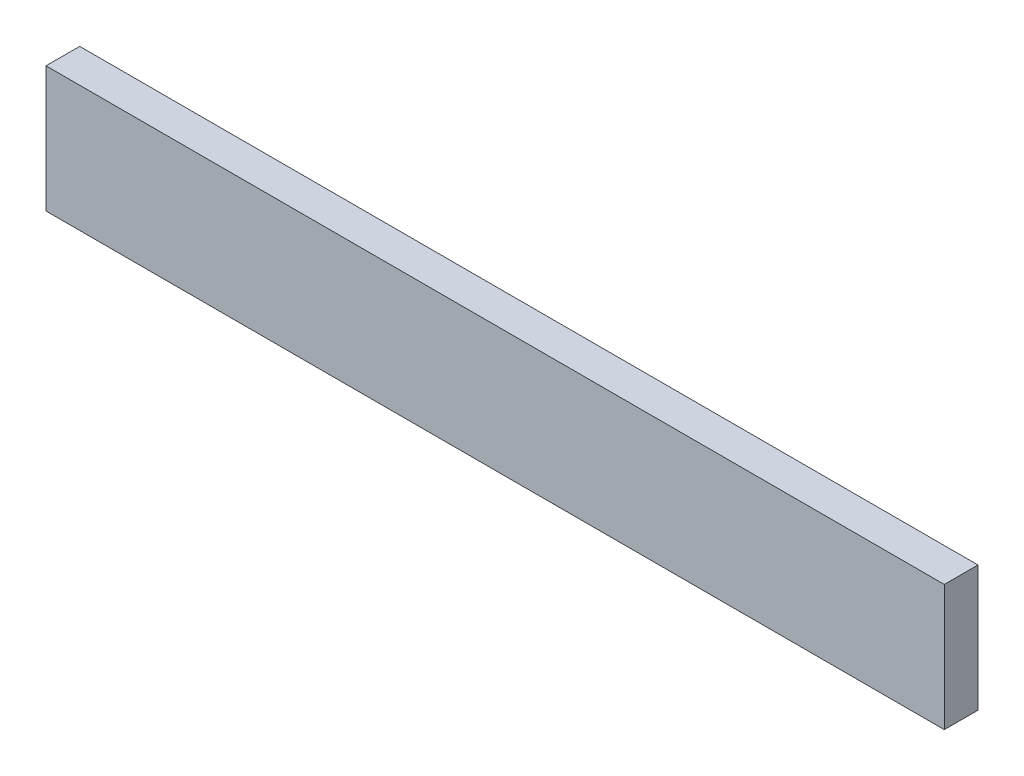
ISO-10303-21;
HEADER;
FILE_DESCRIPTION(('STEP AP214'),'2;1');
FILE_NAME('part.step','',(''),(''),'','','');
FILE_SCHEMA(('AUTOMOTIVE_DESIGN { 1 0 10303 214 1 1 1 1 }'));
ENDSEC;
DATA;
#1=APPLICATION_CONTEXT('core data for automotive mechanical design processes');
#2=APPLICATION_PROTOCOL_DEFINITION('international standard','automotive_design',2000,#1);
#3=PRODUCT_CONTEXT('',#1,'mechanical');
#4=PRODUCT('Part','Part','',(#3));
#5=PRODUCT_RELATED_PRODUCT_CATEGORY('part','',(#4));
#6=PRODUCT_DEFINITION_FORMATION('','',#4);
#7=PRODUCT_DEFINITION_CONTEXT('part definition',#1,'design');
#8=PRODUCT_DEFINITION('design','',#6,#7);
#9=PRODUCT_DEFINITION_SHAPE('','',#8);
#10=(LENGTH_UNIT() NAMED_UNIT(*) SI_UNIT(.MILLI.,.METRE.));
#11=(NAMED_UNIT(*) PLANE_ANGLE_UNIT() SI_UNIT($,.RADIAN.));
#12=(NAMED_UNIT(*) SI_UNIT($,.STERADIAN.) SOLID_ANGLE_UNIT());
#13=UNCERTAINTY_MEASURE_WITH_UNIT(LENGTH_MEASURE(1.E-05),#10,'distance_accuracy_value','');
#14=(GEOMETRIC_REPRESENTATION_CONTEXT(3) GLOBAL_UNCERTAINTY_ASSIGNED_CONTEXT((#13)) GLOBAL_UNIT_ASSIGNED_CONTEXT((#10,
#11,#12)) REPRESENTATION_CONTEXT('',''));
#15=CARTESIAN_POINT('',(0.,0.,0.));
#16=DIRECTION('',(0.,0.,1.));
#17=DIRECTION('',(1.,0.,0.));
#18=AXIS2_PLACEMENT_3D('',#15,#16,#17);
#19=CARTESIAN_POINT('',(0.,0.,2.99999999999999));
#20=DIRECTION('',(1.,0.,0.));
#21=DIRECTION('',(0.,0.,-1.));
#22=AXIS2_PLACEMENT_3D('',#19,#20,#21);
#23=PLANE('',#22);
#24=DIRECTION('',(0.,-1.,0.));
#25=VECTOR('',#24,1.);
#26=CARTESIAN_POINT('',(0.,0.,0.));
#27=LINE('',#26,#25);
#28=CARTESIAN_POINT('',(0.,11.2,0.));
#29=VERTEX_POINT('',#28);
#30=CARTESIAN_POINT('',(0.,0.,0.));
#31=VERTEX_POINT('',#30);
#32=EDGE_CURVE('E96',#29,#31,#27,.T.);
#33=ORIENTED_EDGE('',*,*,#32,.T.);
#34=DIRECTION('',(0.,0.,-1.));
#35=VECTOR('',#34,1.);
#36=CARTESIAN_POINT('',(0.,0.,2.99999999999999));
#37=LINE('',#36,#35);
#38=CARTESIAN_POINT('',(0.,0.,2.99999999999999));
#39=VERTEX_POINT('',#38);
#40=EDGE_CURVE('E11',#39,#31,#37,.T.);
#41=ORIENTED_EDGE('',*,*,#40,.F.);
#42=DIRECTION('',(0.,-1.,0.));
#43=VECTOR('',#42,1.);
#44=CARTESIAN_POINT('',(0.,0.,2.99999999999999));
#45=LINE('',#44,#43);
#46=CARTESIAN_POINT('',(0.,11.2,2.99999999999999));
#47=VERTEX_POINT('',#46);
#48=EDGE_CURVE('E84',#47,#39,#45,.T.);
#49=ORIENTED_EDGE('',*,*,#48,.F.);
#50=DIRECTION('',(0.,0.,-1.));
#51=VECTOR('',#50,1.);
#52=CARTESIAN_POINT('',(0.,11.2,2.99999999999999));
#53=LINE('',#52,#51);
#54=EDGE_CURVE('E92',#47,#29,#53,.T.);
#55=ORIENTED_EDGE('',*,*,#54,.T.);
#56=EDGE_LOOP('',(#33,#41,#49,#55));
#57=FACE_BOUND('',#56,.T.);
#58=ADVANCED_FACE('F33',(#57),#23,.F.);
#59=CARTESIAN_POINT('',(0.,0.,2.99999999999999));
#60=DIRECTION('',(0.,1.,0.));
#61=DIRECTION('',(0.,0.,1.));
#62=AXIS2_PLACEMENT_3D('',#59,#60,#61);
#63=PLANE('',#62);
#64=DIRECTION('',(1.,0.,0.));
#65=VECTOR('',#64,1.);
#66=CARTESIAN_POINT('',(0.,0.,0.));
#67=LINE('',#66,#65);
#68=CARTESIAN_POINT('',(80.,0.,0.));
#69=VERTEX_POINT('',#68);
#70=EDGE_CURVE('E88',#31,#69,#67,.T.);
#71=ORIENTED_EDGE('',*,*,#70,.T.);
#72=DIRECTION('',(0.,0.,-1.));
#73=VECTOR('',#72,1.);
#74=CARTESIAN_POINT('',(80.,0.,2.99999999999999));
#75=LINE('',#74,#73);
#76=CARTESIAN_POINT('',(80.,0.,2.99999999999999));
#77=VERTEX_POINT('',#76);
#78=EDGE_CURVE('E41',#77,#69,#75,.T.);
#79=ORIENTED_EDGE('',*,*,#78,.F.);
#80=DIRECTION('',(1.,0.,0.));
#81=VECTOR('',#80,1.);
#82=CARTESIAN_POINT('',(0.,0.,2.99999999999999));
#83=LINE('',#82,#81);
#84=EDGE_CURVE('E79',#39,#77,#83,.T.);
#85=ORIENTED_EDGE('',*,*,#84,.F.);
#86=ORIENTED_EDGE('',*,*,#40,.T.);
#87=EDGE_LOOP('',(#71,#79,#85,#86));
#88=FACE_BOUND('',#87,.T.);
#89=ADVANCED_FACE('F87',(#88),#63,.F.);
#90=CARTESIAN_POINT('',(80.,0.,2.99999999999999));
#91=DIRECTION('',(-1.,0.,0.));
#92=DIRECTION('',(0.,0.,1.));
#93=AXIS2_PLACEMENT_3D('',#90,#91,#92);
#94=PLANE('',#93);
#95=DIRECTION('',(0.,1.,0.));
#96=VECTOR('',#95,1.);
#97=CARTESIAN_POINT('',(80.,0.,0.));
#98=LINE('',#97,#96);
#99=CARTESIAN_POINT('',(80.,11.2,0.));
#100=VERTEX_POINT('',#99);
#101=EDGE_CURVE('E66',#69,#100,#98,.T.);
#102=ORIENTED_EDGE('',*,*,#101,.T.);
#103=DIRECTION('',(0.,0.,-1.));
#104=VECTOR('',#103,1.);
#105=CARTESIAN_POINT('',(80.,11.2,2.99999999999999));
#106=LINE('',#105,#104);
#107=CARTESIAN_POINT('',(80.,11.2,2.99999999999999));
#108=VERTEX_POINT('',#107);
#109=EDGE_CURVE('E89',#108,#100,#106,.T.);
#110=ORIENTED_EDGE('',*,*,#109,.F.);
#111=DIRECTION('',(0.,1.,0.));
#112=VECTOR('',#111,1.);
#113=CARTESIAN_POINT('',(80.,0.,2.99999999999999));
#114=LINE('',#113,#112);
#115=EDGE_CURVE('E82',#77,#108,#114,.T.);
#116=ORIENTED_EDGE('',*,*,#115,.F.);
#117=ORIENTED_EDGE('',*,*,#78,.T.);
#118=EDGE_LOOP('',(#102,#110,#116,#117));
#119=FACE_BOUND('',#118,.T.);
#120=ADVANCED_FACE('F90',(#119),#94,.F.);
#121=CARTESIAN_POINT('',(0.,11.2,2.99999999999999));
#122=DIRECTION('',(0.,-1.,0.));
#123=DIRECTION('',(0.,0.,-1.));
#124=AXIS2_PLACEMENT_3D('',#121,#122,#123);
#125=PLANE('',#124);
#126=DIRECTION('',(-1.,0.,0.));
#127=VECTOR('',#126,1.);
#128=CARTESIAN_POINT('',(0.,11.2,0.));
#129=LINE('',#128,#127);
#130=EDGE_CURVE('E72',#100,#29,#129,.T.);
#131=ORIENTED_EDGE('',*,*,#130,.T.);
#132=ORIENTED_EDGE('',*,*,#54,.F.);
#133=DIRECTION('',(-1.,0.,0.));
#134=VECTOR('',#133,1.);
#135=CARTESIAN_POINT('',(0.,11.2,2.99999999999999));
#136=LINE('',#135,#134);
#137=EDGE_CURVE('E49',#108,#47,#136,.T.);
#138=ORIENTED_EDGE('',*,*,#137,.F.);
#139=ORIENTED_EDGE('',*,*,#109,.T.);
#140=EDGE_LOOP('',(#131,#132,#138,#139));
#141=FACE_BOUND('',#140,.T.);
#142=ADVANCED_FACE('F103',(#141),#125,.F.);
#143=CARTESIAN_POINT('',(0.,0.,2.99999999999999));
#144=DIRECTION('',(0.,0.,-1.));
#145=DIRECTION('',(-1.,0.,0.));
#146=AXIS2_PLACEMENT_3D('',#143,#144,#145);
#147=PLANE('',#146);
#148=ORIENTED_EDGE('',*,*,#48,.T.);
#149=ORIENTED_EDGE('',*,*,#84,.T.);
#150=ORIENTED_EDGE('',*,*,#115,.T.);
#151=ORIENTED_EDGE('',*,*,#137,.T.);
#152=EDGE_LOOP('',(#148,#149,#150,#151));
#153=FACE_BOUND('',#152,.T.);
#154=ADVANCED_FACE('F80',(#153),#147,.F.);
#155=CARTESIAN_POINT('',(0.,0.,0.));
#156=DIRECTION('',(0.,0.,-1.));
#157=DIRECTION('',(-1.,0.,0.));
#158=AXIS2_PLACEMENT_3D('',#155,#156,#157);
#159=PLANE('',#158);
#160=ORIENTED_EDGE('',*,*,#32,.F.);
#161=ORIENTED_EDGE('',*,*,#130,.F.);
#162=ORIENTED_EDGE('',*,*,#101,.F.);
#163=ORIENTED_EDGE('',*,*,#70,.F.);
#164=EDGE_LOOP('',(#160,#161,#162,#163));
#165=FACE_BOUND('',#164,.T.);
#166=ADVANCED_FACE('F106',(#165),#159,.T.);
#167=CLOSED_SHELL('',(#58,#89,#120,#142,#154,#166));
#168=MANIFOLD_SOLID_BREP('B2',#167);
#169=ADVANCED_BREP_SHAPE_REPRESENTATION('',(#18,#168),#14);
#170=SHAPE_DEFINITION_REPRESENTATION(#9,#169);
ENDSEC;
END-ISO-10303-21;
